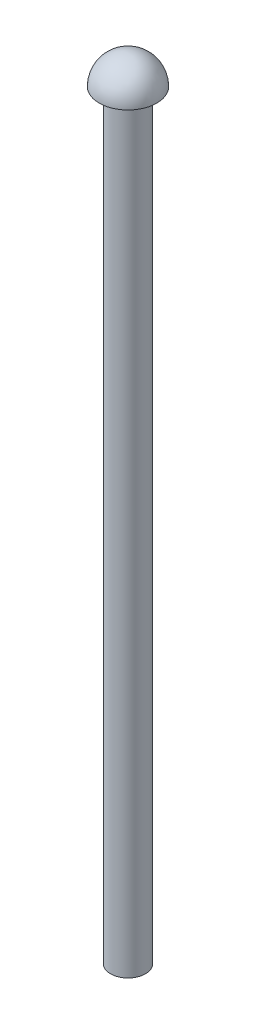
ISO-10303-21;
HEADER;
FILE_DESCRIPTION(('STEP AP214'),'2;1');
FILE_NAME('part.step','',(''),(''),'','','');
FILE_SCHEMA(('AUTOMOTIVE_DESIGN { 1 0 10303 214 1 1 1 1 }'));
ENDSEC;
DATA;
#1=APPLICATION_CONTEXT('core data for automotive mechanical design processes');
#2=APPLICATION_PROTOCOL_DEFINITION('international standard','automotive_design',2000,#1);
#3=PRODUCT_CONTEXT('',#1,'mechanical');
#4=PRODUCT('Part','Part','',(#3));
#5=PRODUCT_RELATED_PRODUCT_CATEGORY('part','',(#4));
#6=PRODUCT_DEFINITION_FORMATION('','',#4);
#7=PRODUCT_DEFINITION_CONTEXT('part definition',#1,'design');
#8=PRODUCT_DEFINITION('design','',#6,#7);
#9=PRODUCT_DEFINITION_SHAPE('','',#8);
#10=(LENGTH_UNIT() NAMED_UNIT(*) SI_UNIT(.MILLI.,.METRE.));
#11=(NAMED_UNIT(*) PLANE_ANGLE_UNIT() SI_UNIT($,.RADIAN.));
#12=(NAMED_UNIT(*) SI_UNIT($,.STERADIAN.) SOLID_ANGLE_UNIT());
#13=UNCERTAINTY_MEASURE_WITH_UNIT(LENGTH_MEASURE(1.E-05),#10,'distance_accuracy_value','');
#14=(GEOMETRIC_REPRESENTATION_CONTEXT(3) GLOBAL_UNCERTAINTY_ASSIGNED_CONTEXT((#13)) GLOBAL_UNIT_ASSIGNED_CONTEXT((#10,
#11,#12)) REPRESENTATION_CONTEXT('',''));
#15=CARTESIAN_POINT('',(0.,0.,0.));
#16=DIRECTION('',(0.,0.,1.));
#17=DIRECTION('',(1.,0.,0.));
#18=AXIS2_PLACEMENT_3D('',#15,#16,#17);
#19=CARTESIAN_POINT('',(0.,0.,0.));
#20=DIRECTION('',(0.,-1.,0.));
#21=DIRECTION('',(0.,0.,1.));
#22=AXIS2_PLACEMENT_3D('',#19,#20,#21);
#23=SPHERICAL_SURFACE('',#22,1.44);
#24=CARTESIAN_POINT('',(0.,0.,0.));
#25=DIRECTION('',(0.,-1.,0.));
#26=DIRECTION('',(0.,0.,-1.));
#27=AXIS2_PLACEMENT_3D('',#24,#25,#26);
#28=CIRCLE('',#27,1.44);
#29=CARTESIAN_POINT('',(0.,0.,-1.44));
#30=VERTEX_POINT('',#29);
#31=EDGE_CURVE('E43',#30,#30,#28,.T.);
#32=ORIENTED_EDGE('',*,*,#31,.F.);
#33=EDGE_LOOP('',(#32));
#34=FACE_BOUND('',#33,.T.);
#35=ADVANCED_FACE('F31',(#34),#23,.T.);
#36=CARTESIAN_POINT('',(0.,0.,0.));
#37=DIRECTION('',(0.,1.,0.));
#38=DIRECTION('',(0.,0.,1.));
#39=AXIS2_PLACEMENT_3D('',#36,#37,#38);
#40=PLANE('',#39);
#41=CARTESIAN_POINT('',(0.,0.,0.));
#42=DIRECTION('',(0.,1.,0.));
#43=DIRECTION('',(0.,0.,1.));
#44=AXIS2_PLACEMENT_3D('',#41,#42,#43);
#45=CIRCLE('',#44,0.875);
#46=CARTESIAN_POINT('',(0.,0.,0.875));
#47=VERTEX_POINT('',#46);
#48=EDGE_CURVE('E10',#47,#47,#45,.F.);
#49=ORIENTED_EDGE('',*,*,#48,.F.);
#50=EDGE_LOOP('',(#49));
#51=FACE_BOUND('',#50,.T.);
#52=ORIENTED_EDGE('',*,*,#31,.T.);
#53=EDGE_LOOP('',(#52));
#54=FACE_BOUND('',#53,.T.);
#55=ADVANCED_FACE('F57',(#51,#54),#40,.F.);
#56=CARTESIAN_POINT('',(0.,-38.,0.));
#57=DIRECTION('',(0.,1.,0.));
#58=DIRECTION('',(0.,0.,1.));
#59=AXIS2_PLACEMENT_3D('',#56,#57,#58);
#60=CYLINDRICAL_SURFACE('',#59,0.875);
#61=CARTESIAN_POINT('',(0.,-38.,0.));
#62=DIRECTION('',(0.,-1.,0.));
#63=DIRECTION('',(0.,0.,-1.));
#64=AXIS2_PLACEMENT_3D('',#61,#62,#63);
#65=CIRCLE('',#64,0.875);
#66=CARTESIAN_POINT('',(0.,-38.,-0.875));
#67=VERTEX_POINT('',#66);
#68=EDGE_CURVE('E47',#67,#67,#65,.T.);
#69=ORIENTED_EDGE('',*,*,#68,.F.);
#70=EDGE_LOOP('',(#69));
#71=FACE_BOUND('',#70,.T.);
#72=ORIENTED_EDGE('',*,*,#48,.T.);
#73=EDGE_LOOP('',(#72));
#74=FACE_BOUND('',#73,.T.);
#75=ADVANCED_FACE('F55',(#71,#74),#60,.T.);
#76=CARTESIAN_POINT('',(0.,-38.,0.));
#77=DIRECTION('',(0.,-1.,0.));
#78=DIRECTION('',(0.,0.,-1.));
#79=AXIS2_PLACEMENT_3D('',#76,#77,#78);
#80=PLANE('',#79);
#81=ORIENTED_EDGE('',*,*,#68,.T.);
#82=EDGE_LOOP('',(#81));
#83=FACE_BOUND('',#82,.T.);
#84=ADVANCED_FACE('F53',(#83),#80,.T.);
#85=CLOSED_SHELL('',(#35,#55,#75,#84));
#86=CARTESIAN_POINT('',(0.,0.1,0.));
#87=DIRECTION('',(0.,1.,0.));
#88=DIRECTION('',(0.,0.,1.));
#89=AXIS2_PLACEMENT_3D('',#86,#87,#88);
#90=PLANE('',#89);
#91=CARTESIAN_POINT('',(0.,0.1,0.));
#92=DIRECTION('',(0.,-1.,0.));
#93=DIRECTION('',(0.,0.,-1.));
#94=AXIS2_PLACEMENT_3D('',#91,#92,#93);
#95=CIRCLE('',#94,1.33626344707921);
#96=CARTESIAN_POINT('',(0.,0.1,-1.33626344707921));
#97=VERTEX_POINT('',#96);
#98=EDGE_CURVE('E39',#97,#97,#95,.T.);
#99=ORIENTED_EDGE('',*,*,#98,.F.);
#100=EDGE_LOOP('',(#99));
#101=FACE_BOUND('',#100,.T.);
#102=ADVANCED_FACE('F33',(#101),#90,.T.);
#103=CARTESIAN_POINT('',(0.,0.,0.));
#104=DIRECTION('',(0.,-1.,0.));
#105=DIRECTION('',(0.,0.,1.));
#106=AXIS2_PLACEMENT_3D('',#103,#104,#105);
#107=SPHERICAL_SURFACE('',#106,1.34);
#108=ORIENTED_EDGE('',*,*,#98,.T.);
#109=EDGE_LOOP('',(#108));
#110=FACE_BOUND('',#109,.T.);
#111=ADVANCED_FACE('F72',(#110),#107,.F.);
#112=CLOSED_SHELL('',(#102,#111));
#113=ORIENTED_CLOSED_SHELL('',*,#112,.T.);
#114=BREP_WITH_VOIDS('B2',#85,(#113));
#115=ADVANCED_BREP_SHAPE_REPRESENTATION('',(#18,#114),#14);
#116=SHAPE_DEFINITION_REPRESENTATION(#9,#115);
ENDSEC;
END-ISO-10303-21;
